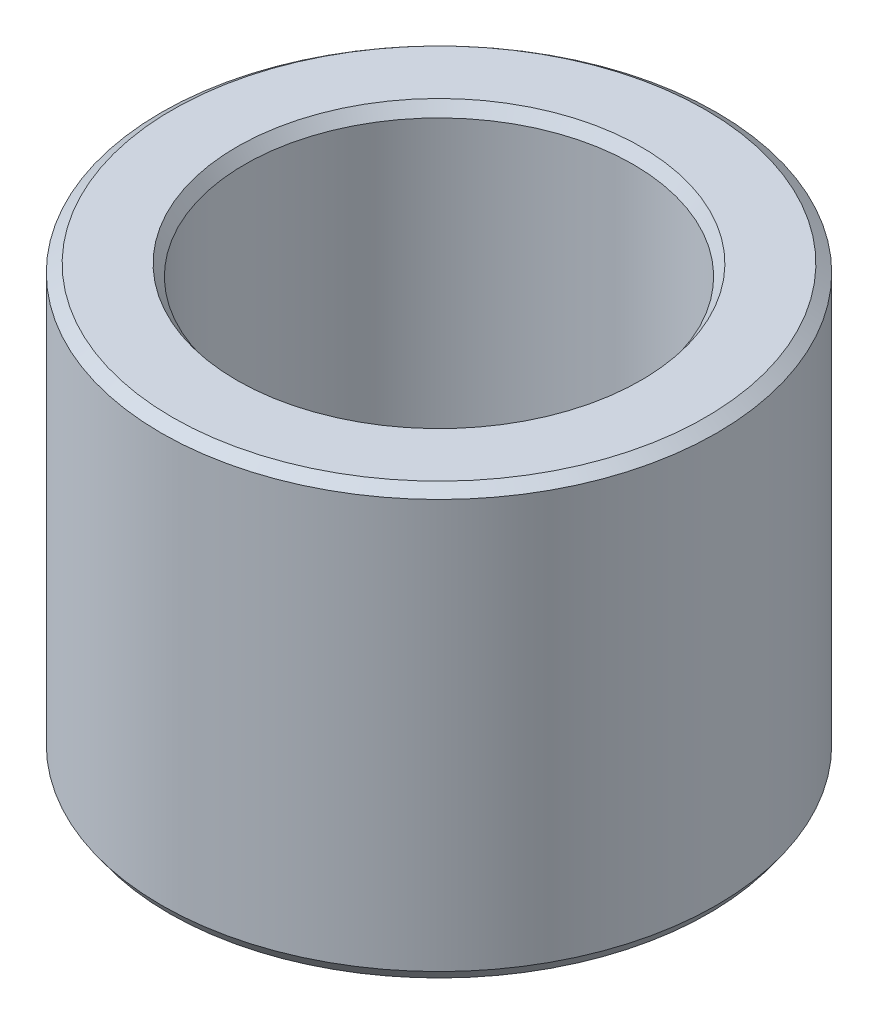
ISO-10303-21;
HEADER;
FILE_DESCRIPTION(('STEP AP214'),'2;1');
FILE_NAME('part.step','',(''),(''),'','','');
FILE_SCHEMA(('AUTOMOTIVE_DESIGN { 1 0 10303 214 1 1 1 1 }'));
ENDSEC;
DATA;
#1=APPLICATION_CONTEXT('core data for automotive mechanical design processes');
#2=APPLICATION_PROTOCOL_DEFINITION('international standard','automotive_design',2000,#1);
#3=PRODUCT_CONTEXT('',#1,'mechanical');
#4=PRODUCT('Part','Part','',(#3));
#5=PRODUCT_RELATED_PRODUCT_CATEGORY('part','',(#4));
#6=PRODUCT_DEFINITION_FORMATION('','',#4);
#7=PRODUCT_DEFINITION_CONTEXT('part definition',#1,'design');
#8=PRODUCT_DEFINITION('design','',#6,#7);
#9=PRODUCT_DEFINITION_SHAPE('','',#8);
#10=(LENGTH_UNIT() NAMED_UNIT(*) SI_UNIT(.MILLI.,.METRE.));
#11=(NAMED_UNIT(*) PLANE_ANGLE_UNIT() SI_UNIT($,.RADIAN.));
#12=(NAMED_UNIT(*) SI_UNIT($,.STERADIAN.) SOLID_ANGLE_UNIT());
#13=UNCERTAINTY_MEASURE_WITH_UNIT(LENGTH_MEASURE(1.E-05),#10,'distance_accuracy_value','');
#14=(GEOMETRIC_REPRESENTATION_CONTEXT(3) GLOBAL_UNCERTAINTY_ASSIGNED_CONTEXT((#13)) GLOBAL_UNIT_ASSIGNED_CONTEXT((#10,
#11,#12)) REPRESENTATION_CONTEXT('',''));
#15=CARTESIAN_POINT('',(0.,0.,0.));
#16=DIRECTION('',(0.,0.,1.));
#17=DIRECTION('',(1.,0.,0.));
#18=AXIS2_PLACEMENT_3D('',#15,#16,#17);
#19=CARTESIAN_POINT('',(0.,69.3564389373815,0.));
#20=DIRECTION('',(0.,-1.,0.));
#21=DIRECTION('',(0.,0.,-1.));
#22=AXIS2_PLACEMENT_3D('',#19,#20,#21);
#23=CYLINDRICAL_SURFACE('',#22,45.);
#24=CARTESIAN_POINT('',(0.,1.81509314627902,0.));
#25=DIRECTION('',(0.,1.,0.));
#26=DIRECTION('',(0.,0.,1.));
#27=AXIS2_PLACEMENT_3D('',#24,#25,#26);
#28=CIRCLE('',#27,45.);
#29=CARTESIAN_POINT('',(0.,1.81509314627902,45.));
#30=VERTEX_POINT('',#29);
#31=EDGE_CURVE('E10',#30,#30,#28,.T.);
#32=ORIENTED_EDGE('',*,*,#31,.T.);
#33=EDGE_LOOP('',(#32));
#34=FACE_BOUND('',#33,.T.);
#35=CARTESIAN_POINT('',(0.,68.0645871576997,0.));
#36=DIRECTION('',(0.,1.,0.));
#37=DIRECTION('',(0.,0.,1.));
#38=AXIS2_PLACEMENT_3D('',#35,#36,#37);
#39=CIRCLE('',#38,45.);
#40=CARTESIAN_POINT('',(0.,68.0645871576997,45.));
#41=VERTEX_POINT('',#40);
#42=EDGE_CURVE('E50',#41,#41,#39,.F.);
#43=ORIENTED_EDGE('',*,*,#42,.T.);
#44=EDGE_LOOP('',(#43));
#45=FACE_BOUND('',#44,.T.);
#46=ADVANCED_FACE('F39',(#34,#45),#23,.T.);
#47=CARTESIAN_POINT('',(0.,69.3564389373815,0.));
#48=DIRECTION('',(0.,1.,0.));
#49=DIRECTION('',(0.,0.,1.));
#50=AXIS2_PLACEMENT_3D('',#47,#48,#49);
#51=PLANE('',#50);
#52=CARTESIAN_POINT('',(0.,69.3564389373815,0.));
#53=DIRECTION('',(0.,1.,0.));
#54=DIRECTION('',(0.,0.,1.));
#55=AXIS2_PLACEMENT_3D('',#52,#53,#54);
#56=CIRCLE('',#55,32.7620192375707);
#57=CARTESIAN_POINT('',(0.,69.3564389373815,32.7620192375707));
#58=VERTEX_POINT('',#57);
#59=EDGE_CURVE('E58',#58,#58,#56,.F.);
#60=ORIENTED_EDGE('',*,*,#59,.T.);
#61=EDGE_LOOP('',(#60));
#62=FACE_BOUND('',#61,.T.);
#63=CARTESIAN_POINT('',(0.,69.3564389373815,0.));
#64=DIRECTION('',(0.,1.,0.));
#65=DIRECTION('',(0.,0.,1.));
#66=AXIS2_PLACEMENT_3D('',#63,#64,#65);
#67=CIRCLE('',#66,43.184906853721);
#68=CARTESIAN_POINT('',(0.,69.3564389373815,43.184906853721));
#69=VERTEX_POINT('',#68);
#70=EDGE_CURVE('E61',#69,#69,#67,.T.);
#71=ORIENTED_EDGE('',*,*,#70,.T.);
#72=EDGE_LOOP('',(#71));
#73=FACE_BOUND('',#72,.T.);
#74=ADVANCED_FACE('F88',(#62,#73),#51,.T.);
#75=CARTESIAN_POINT('',(0.,0.,0.));
#76=DIRECTION('',(0.,1.,0.));
#77=DIRECTION('',(0.,0.,1.));
#78=AXIS2_PLACEMENT_3D('',#75,#76,#77);
#79=PLANE('',#78);
#80=CARTESIAN_POINT('',(0.,0.,0.));
#81=DIRECTION('',(0.,1.,0.));
#82=DIRECTION('',(0.,0.,1.));
#83=AXIS2_PLACEMENT_3D('',#80,#81,#82);
#84=CIRCLE('',#83,33.285260604168);
#85=CARTESIAN_POINT('',(0.,0.,33.285260604168));
#86=VERTEX_POINT('',#85);
#87=EDGE_CURVE('E51',#86,#86,#84,.T.);
#88=ORIENTED_EDGE('',*,*,#87,.T.);
#89=EDGE_LOOP('',(#88));
#90=FACE_BOUND('',#89,.T.);
#91=CARTESIAN_POINT('',(0.,0.,0.));
#92=DIRECTION('',(0.,1.,0.));
#93=DIRECTION('',(0.,0.,1.));
#94=AXIS2_PLACEMENT_3D('',#91,#92,#93);
#95=CIRCLE('',#94,43.7081482203182);
#96=CARTESIAN_POINT('',(0.,0.,43.7081482203182));
#97=VERTEX_POINT('',#96);
#98=EDGE_CURVE('E54',#97,#97,#95,.F.);
#99=ORIENTED_EDGE('',*,*,#98,.T.);
#100=EDGE_LOOP('',(#99));
#101=FACE_BOUND('',#100,.T.);
#102=ADVANCED_FACE('F83',(#90,#101),#79,.F.);
#103=CARTESIAN_POINT('',(0.,69.3564389373815,0.));
#104=DIRECTION('',(0.,-1.,0.));
#105=DIRECTION('',(0.,0.,-1.));
#106=AXIS2_PLACEMENT_3D('',#103,#104,#105);
#107=CYLINDRICAL_SURFACE('',#106,31.470167457889);
#108=CARTESIAN_POINT('',(0.,67.5413457911025,0.));
#109=DIRECTION('',(0.,1.,0.));
#110=DIRECTION('',(0.,0.,1.));
#111=AXIS2_PLACEMENT_3D('',#108,#109,#110);
#112=CIRCLE('',#111,31.470167457889);
#113=CARTESIAN_POINT('',(0.,67.5413457911025,31.470167457889));
#114=VERTEX_POINT('',#113);
#115=EDGE_CURVE('E67',#114,#114,#112,.T.);
#116=ORIENTED_EDGE('',*,*,#115,.T.);
#117=EDGE_LOOP('',(#116));
#118=FACE_BOUND('',#117,.T.);
#119=CARTESIAN_POINT('',(0.,1.29185177968179,0.));
#120=DIRECTION('',(0.,1.,0.));
#121=DIRECTION('',(0.,0.,1.));
#122=AXIS2_PLACEMENT_3D('',#119,#120,#121);
#123=CIRCLE('',#122,31.470167457889);
#124=CARTESIAN_POINT('',(0.,1.29185177968179,31.470167457889));
#125=VERTEX_POINT('',#124);
#126=EDGE_CURVE('E69',#125,#125,#123,.F.);
#127=ORIENTED_EDGE('',*,*,#126,.T.);
#128=EDGE_LOOP('',(#127));
#129=FACE_BOUND('',#128,.T.);
#130=ADVANCED_FACE('F71',(#118,#129),#107,.F.);
#131=CARTESIAN_POINT('',(0.,67.5413457911025,0.));
#132=DIRECTION('',(0.,1.,0.));
#133=DIRECTION('',(0.,0.,1.));
#134=AXIS2_PLACEMENT_3D('',#131,#132,#133);
#135=CONICAL_SURFACE('',#134,31.470167457889,0.618553509278784);
#136=ORIENTED_EDGE('',*,*,#59,.F.);
#137=EDGE_LOOP('',(#136));
#138=FACE_BOUND('',#137,.T.);
#139=ORIENTED_EDGE('',*,*,#115,.F.);
#140=EDGE_LOOP('',(#139));
#141=FACE_BOUND('',#140,.T.);
#142=ADVANCED_FACE('F77',(#138,#141),#135,.F.);
#143=CARTESIAN_POINT('',(0.,0.,0.));
#144=DIRECTION('',(0.,-1.,0.));
#145=DIRECTION('',(0.,0.,-1.));
#146=AXIS2_PLACEMENT_3D('',#143,#144,#145);
#147=CONICAL_SURFACE('',#146,33.285260604168,0.952242817516108);
#148=ORIENTED_EDGE('',*,*,#126,.F.);
#149=EDGE_LOOP('',(#148));
#150=FACE_BOUND('',#149,.T.);
#151=ORIENTED_EDGE('',*,*,#87,.F.);
#152=EDGE_LOOP('',(#151));
#153=FACE_BOUND('',#152,.T.);
#154=ADVANCED_FACE('F73',(#150,#153),#147,.F.);
#155=CARTESIAN_POINT('',(0.,1.81509314627902,0.));
#156=DIRECTION('',(0.,1.,0.));
#157=DIRECTION('',(0.,0.,1.));
#158=AXIS2_PLACEMENT_3D('',#155,#156,#157);
#159=CONICAL_SURFACE('',#158,45.,0.618553509278792);
#160=ORIENTED_EDGE('',*,*,#98,.F.);
#161=EDGE_LOOP('',(#160));
#162=FACE_BOUND('',#161,.T.);
#163=ORIENTED_EDGE('',*,*,#31,.F.);
#164=EDGE_LOOP('',(#163));
#165=FACE_BOUND('',#164,.T.);
#166=ADVANCED_FACE('F76',(#162,#165),#159,.T.);
#167=CARTESIAN_POINT('',(0.,69.3564389373815,0.));
#168=DIRECTION('',(0.,-1.,0.));
#169=DIRECTION('',(0.,0.,-1.));
#170=AXIS2_PLACEMENT_3D('',#167,#168,#169);
#171=CONICAL_SURFACE('',#170,43.184906853721,0.95224281751611);
#172=ORIENTED_EDGE('',*,*,#42,.F.);
#173=EDGE_LOOP('',(#172));
#174=FACE_BOUND('',#173,.T.);
#175=ORIENTED_EDGE('',*,*,#70,.F.);
#176=EDGE_LOOP('',(#175));
#177=FACE_BOUND('',#176,.T.);
#178=ADVANCED_FACE('F45',(#174,#177),#171,.T.);
#179=CLOSED_SHELL('',(#46,#74,#102,#130,#142,#154,#166,#178));
#180=MANIFOLD_SOLID_BREP('B2',#179);
#181=ADVANCED_BREP_SHAPE_REPRESENTATION('',(#18,#180),#14);
#182=SHAPE_DEFINITION_REPRESENTATION(#9,#181);
ENDSEC;
END-ISO-10303-21;
